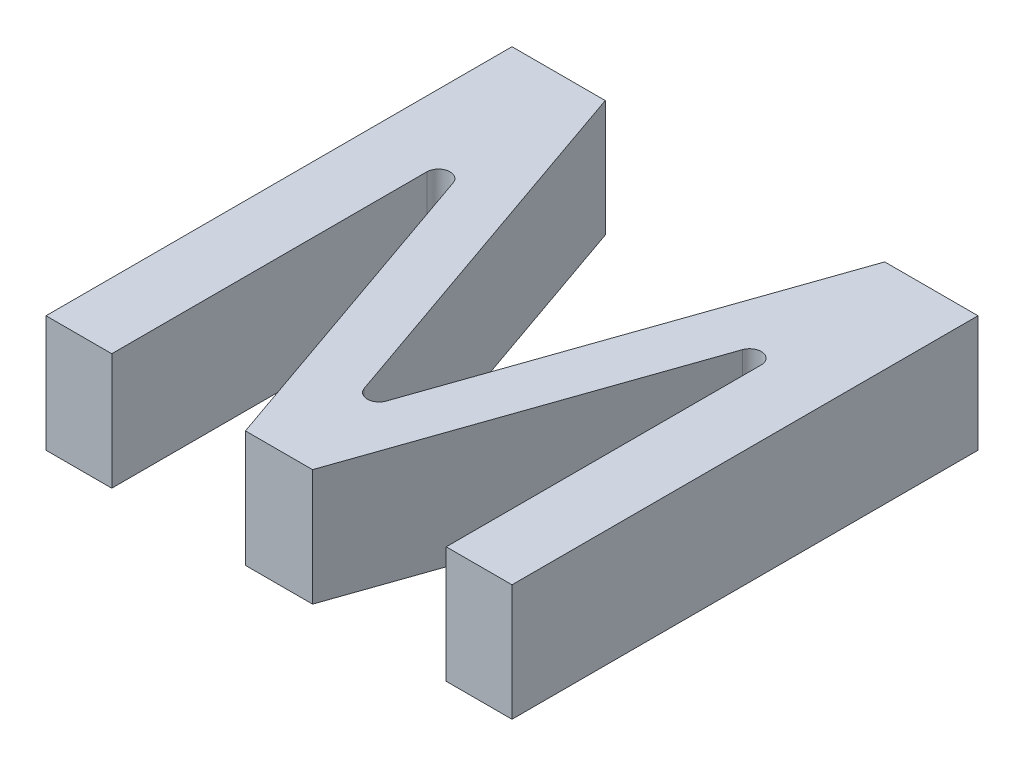
ISO-10303-21;
HEADER;
FILE_DESCRIPTION(('STEP AP214'),'2;1');
FILE_NAME('part.step','',(''),(''),'','','');
FILE_SCHEMA(('AUTOMOTIVE_DESIGN { 1 0 10303 214 1 1 1 1 }'));
ENDSEC;
DATA;
#1=APPLICATION_CONTEXT('core data for automotive mechanical design processes');
#2=APPLICATION_PROTOCOL_DEFINITION('international standard','automotive_design',2000,#1);
#3=PRODUCT_CONTEXT('',#1,'mechanical');
#4=PRODUCT('Part','Part','',(#3));
#5=PRODUCT_RELATED_PRODUCT_CATEGORY('part','',(#4));
#6=PRODUCT_DEFINITION_FORMATION('','',#4);
#7=PRODUCT_DEFINITION_CONTEXT('part definition',#1,'design');
#8=PRODUCT_DEFINITION('design','',#6,#7);
#9=PRODUCT_DEFINITION_SHAPE('','',#8);
#10=(LENGTH_UNIT() NAMED_UNIT(*) SI_UNIT(.MILLI.,.METRE.));
#11=(NAMED_UNIT(*) PLANE_ANGLE_UNIT() SI_UNIT($,.RADIAN.));
#12=(NAMED_UNIT(*) SI_UNIT($,.STERADIAN.) SOLID_ANGLE_UNIT());
#13=UNCERTAINTY_MEASURE_WITH_UNIT(LENGTH_MEASURE(1.E-05),#10,'distance_accuracy_value','');
#14=(GEOMETRIC_REPRESENTATION_CONTEXT(3) GLOBAL_UNCERTAINTY_ASSIGNED_CONTEXT((#13)) GLOBAL_UNIT_ASSIGNED_CONTEXT((#10,
#11,#12)) REPRESENTATION_CONTEXT('',''));
#15=CARTESIAN_POINT('',(0.,0.,0.));
#16=DIRECTION('',(0.,0.,1.));
#17=DIRECTION('',(1.,0.,0.));
#18=AXIS2_PLACEMENT_3D('',#15,#16,#17);
#19=CARTESIAN_POINT('',(34.3542511994083,10.,0.));
#20=DIRECTION('',(1.,0.,0.));
#21=DIRECTION('',(0.,0.,-1.));
#22=AXIS2_PLACEMENT_3D('',#19,#20,#21);
#23=PLANE('',#22);
#24=DIRECTION('',(0.,0.,1.));
#25=VECTOR('',#24,1.);
#26=CARTESIAN_POINT('',(34.3542511994083,10.,0.));
#27=LINE('',#26,#25);
#28=CARTESIAN_POINT('',(34.3542511994083,10.,-27.040857986131));
#29=VERTEX_POINT('',#28);
#30=CARTESIAN_POINT('',(34.3542511994083,10.,0.));
#31=VERTEX_POINT('',#30);
#32=EDGE_CURVE('E152',#29,#31,#27,.T.);
#33=ORIENTED_EDGE('',*,*,#32,.F.);
#34=DIRECTION('',(0.,-1.,0.));
#35=VECTOR('',#34,1.);
#36=CARTESIAN_POINT('',(34.3542511994083,10.,-27.040857986131));
#37=LINE('',#36,#35);
#38=CARTESIAN_POINT('',(34.3542511994083,0.,-27.040857986131));
#39=VERTEX_POINT('',#38);
#40=EDGE_CURVE('E178',#29,#39,#37,.T.);
#41=ORIENTED_EDGE('',*,*,#40,.T.);
#42=DIRECTION('',(0.,0.,1.));
#43=VECTOR('',#42,1.);
#44=CARTESIAN_POINT('',(34.3542511994083,0.,0.));
#45=LINE('',#44,#43);
#46=CARTESIAN_POINT('',(34.3542511994083,0.,0.));
#47=VERTEX_POINT('',#46);
#48=EDGE_CURVE('E176',#39,#47,#45,.T.);
#49=ORIENTED_EDGE('',*,*,#48,.T.);
#50=DIRECTION('',(0.,-1.,0.));
#51=VECTOR('',#50,1.);
#52=CARTESIAN_POINT('',(34.3542511994083,10.,0.));
#53=LINE('',#52,#51);
#54=EDGE_CURVE('E169',#31,#47,#53,.T.);
#55=ORIENTED_EDGE('',*,*,#54,.F.);
#56=EDGE_LOOP('',(#33,#41,#49,#55));
#57=FACE_BOUND('',#56,.T.);
#58=ADVANCED_FACE('F40',(#57),#23,.F.);
#59=CARTESIAN_POINT('',(0.,10.,0.));
#60=DIRECTION('',(0.,0.,-1.));
#61=DIRECTION('',(-1.,0.,0.));
#62=AXIS2_PLACEMENT_3D('',#59,#60,#61);
#63=PLANE('',#62);
#64=DIRECTION('',(1.,0.,0.));
#65=VECTOR('',#64,1.);
#66=CARTESIAN_POINT('',(0.,0.,0.));
#67=LINE('',#66,#65);
#68=CARTESIAN_POINT('',(40.,0.,0.));
#69=VERTEX_POINT('',#68);
#70=EDGE_CURVE('E272',#47,#69,#67,.T.);
#71=ORIENTED_EDGE('',*,*,#70,.T.);
#72=DIRECTION('',(0.,-1.,0.));
#73=VECTOR('',#72,1.);
#74=CARTESIAN_POINT('',(40.,10.,0.));
#75=LINE('',#74,#73);
#76=CARTESIAN_POINT('',(40.,10.,0.));
#77=VERTEX_POINT('',#76);
#78=EDGE_CURVE('E171',#77,#69,#75,.T.);
#79=ORIENTED_EDGE('',*,*,#78,.F.);
#80=DIRECTION('',(1.,0.,0.));
#81=VECTOR('',#80,1.);
#82=CARTESIAN_POINT('',(0.,10.,0.));
#83=LINE('',#82,#81);
#84=EDGE_CURVE('E156',#31,#77,#83,.T.);
#85=ORIENTED_EDGE('',*,*,#84,.F.);
#86=ORIENTED_EDGE('',*,*,#54,.T.);
#87=EDGE_LOOP('',(#71,#79,#85,#86));
#88=FACE_BOUND('',#87,.T.);
#89=ADVANCED_FACE('F168',(#88),#63,.F.);
#90=CARTESIAN_POINT('',(40.,10.,0.));
#91=DIRECTION('',(-1.,0.,0.));
#92=DIRECTION('',(0.,0.,1.));
#93=AXIS2_PLACEMENT_3D('',#90,#91,#92);
#94=PLANE('',#93);
#95=DIRECTION('',(0.,0.,-1.));
#96=VECTOR('',#95,1.);
#97=CARTESIAN_POINT('',(40.,0.,0.));
#98=LINE('',#97,#96);
#99=CARTESIAN_POINT('',(40.,0.,-40.));
#100=VERTEX_POINT('',#99);
#101=EDGE_CURVE('E270',#69,#100,#98,.T.);
#102=ORIENTED_EDGE('',*,*,#101,.T.);
#103=DIRECTION('',(0.,-1.,0.));
#104=VECTOR('',#103,1.);
#105=CARTESIAN_POINT('',(40.,10.,-40.));
#106=LINE('',#105,#104);
#107=CARTESIAN_POINT('',(40.,10.,-40.));
#108=VERTEX_POINT('',#107);
#109=EDGE_CURVE('E182',#108,#100,#106,.T.);
#110=ORIENTED_EDGE('',*,*,#109,.F.);
#111=DIRECTION('',(0.,0.,-1.));
#112=VECTOR('',#111,1.);
#113=CARTESIAN_POINT('',(40.,10.,0.));
#114=LINE('',#113,#112);
#115=EDGE_CURVE('E173',#77,#108,#114,.T.);
#116=ORIENTED_EDGE('',*,*,#115,.F.);
#117=ORIENTED_EDGE('',*,*,#78,.T.);
#118=EDGE_LOOP('',(#102,#110,#116,#117));
#119=FACE_BOUND('',#118,.T.);
#120=ADVANCED_FACE('F271',(#119),#94,.F.);
#121=CARTESIAN_POINT('',(0.,10.,-40.));
#122=DIRECTION('',(0.,0.,-1.));
#123=DIRECTION('',(-1.,0.,0.));
#124=AXIS2_PLACEMENT_3D('',#121,#122,#123);
#125=PLANE('',#124);
#126=DIRECTION('',(1.,0.,0.));
#127=VECTOR('',#126,1.);
#128=CARTESIAN_POINT('',(0.,0.,-40.));
#129=LINE('',#128,#127);
#130=CARTESIAN_POINT('',(31.9953760727811,0.,-40.));
#131=VERTEX_POINT('',#130);
#132=EDGE_CURVE('E265',#131,#100,#129,.T.);
#133=ORIENTED_EDGE('',*,*,#132,.F.);
#134=DIRECTION('',(0.,-1.,0.));
#135=VECTOR('',#134,1.);
#136=CARTESIAN_POINT('',(31.9953760727811,10.,-40.));
#137=LINE('',#136,#135);
#138=CARTESIAN_POINT('',(31.9953760727811,10.,-40.));
#139=VERTEX_POINT('',#138);
#140=EDGE_CURVE('E257',#139,#131,#137,.T.);
#141=ORIENTED_EDGE('',*,*,#140,.F.);
#142=DIRECTION('',(1.,0.,0.));
#143=VECTOR('',#142,1.);
#144=CARTESIAN_POINT('',(0.,10.,-40.));
#145=LINE('',#144,#143);
#146=EDGE_CURVE('E267',#139,#108,#145,.T.);
#147=ORIENTED_EDGE('',*,*,#146,.T.);
#148=ORIENTED_EDGE('',*,*,#109,.T.);
#149=EDGE_LOOP('',(#133,#141,#147,#148));
#150=FACE_BOUND('',#149,.T.);
#151=ADVANCED_FACE('F263',(#150),#125,.T.);
#152=CARTESIAN_POINT('',(16.1154493969391,10.,5.61078200234492));
#153=DIRECTION('',(0.944398412927786,0.,0.328803341922613));
#154=DIRECTION('',(0.328803341922613,0.,-0.944398412927786));
#155=AXIS2_PLACEMENT_3D('',#152,#153,#154);
#156=PLANE('',#155);
#157=DIRECTION('',(-0.328803341922613,0.,0.944398412927786));
#158=VECTOR('',#157,1.);
#159=CARTESIAN_POINT('',(16.1154493969391,0.,5.61078200234492));
#160=LINE('',#159,#158);
#161=CARTESIAN_POINT('',(20.9443984129278,0.,-8.25906421072143));
#162=VERTEX_POINT('',#161);
#163=EDGE_CURVE('E274',#131,#162,#160,.T.);
#164=ORIENTED_EDGE('',*,*,#163,.T.);
#165=DIRECTION('',(0.,-1.,0.));
#166=VECTOR('',#165,1.);
#167=CARTESIAN_POINT('',(20.9443984129278,10.,-8.25906421072143));
#168=LINE('',#167,#166);
#169=CARTESIAN_POINT('',(20.9443984129278,10.,-8.25906421072143));
#170=VERTEX_POINT('',#169);
#171=EDGE_CURVE('E55',#162,#170,#168,.F.);
#172=ORIENTED_EDGE('',*,*,#171,.T.);
#173=DIRECTION('',(-0.328803341922613,0.,0.944398412927786));
#174=VECTOR('',#173,1.);
#175=CARTESIAN_POINT('',(16.1154493969391,10.,5.61078200234492));
#176=LINE('',#175,#174);
#177=EDGE_CURVE('E306',#139,#170,#176,.T.);
#178=ORIENTED_EDGE('',*,*,#177,.F.);
#179=ORIENTED_EDGE('',*,*,#140,.T.);
#180=EDGE_LOOP('',(#164,#172,#178,#179));
#181=FACE_BOUND('',#180,.T.);
#182=ADVANCED_FACE('F344',(#181),#156,.F.);
#183=CARTESIAN_POINT('',(19.5600850966818,10.,-6.81007216873779));
#184=DIRECTION('',(0.944398412927786,0.,-0.328803341922613));
#185=DIRECTION('',(-0.328803341922613,0.,-0.944398412927786));
#186=AXIS2_PLACEMENT_3D('',#183,#184,#185);
#187=PLANE('',#186);
#188=DIRECTION('',(0.328803341922613,0.,0.944398412927786));
#189=VECTOR('',#188,1.);
#190=CARTESIAN_POINT('',(19.5600850966818,10.,-6.81007216873779));
#191=LINE('',#190,#189);
#192=CARTESIAN_POINT('',(8.00462392721893,10.,-40.));
#193=VERTEX_POINT('',#192);
#194=CARTESIAN_POINT('',(19.0556015870722,10.,-8.25906421072143));
#195=VERTEX_POINT('',#194);
#196=EDGE_CURVE('E303',#193,#195,#191,.T.);
#197=ORIENTED_EDGE('',*,*,#196,.T.);
#198=DIRECTION('',(0.,-1.,0.));
#199=VECTOR('',#198,1.);
#200=CARTESIAN_POINT('',(19.0556015870722,10.,-8.25906421072143));
#201=LINE('',#200,#199);
#202=CARTESIAN_POINT('',(19.0556015870722,0.,-8.25906421072143));
#203=VERTEX_POINT('',#202);
#204=EDGE_CURVE('E192',#195,#203,#201,.T.);
#205=ORIENTED_EDGE('',*,*,#204,.T.);
#206=DIRECTION('',(0.328803341922613,0.,0.944398412927786));
#207=VECTOR('',#206,1.);
#208=CARTESIAN_POINT('',(19.5600850966818,0.,-6.81007216873779));
#209=LINE('',#208,#207);
#210=CARTESIAN_POINT('',(8.00462392721893,0.,-40.));
#211=VERTEX_POINT('',#210);
#212=EDGE_CURVE('E276',#211,#203,#209,.T.);
#213=ORIENTED_EDGE('',*,*,#212,.F.);
#214=DIRECTION('',(0.,-1.,0.));
#215=VECTOR('',#214,1.);
#216=CARTESIAN_POINT('',(8.00462392721893,10.,-40.));
#217=LINE('',#216,#215);
#218=EDGE_CURVE('E255',#193,#211,#217,.T.);
#219=ORIENTED_EDGE('',*,*,#218,.F.);
#220=EDGE_LOOP('',(#197,#205,#213,#219));
#221=FACE_BOUND('',#220,.T.);
#222=ADVANCED_FACE('F301',(#221),#187,.T.);
#223=CARTESIAN_POINT('',(0.,10.,-40.));
#224=DIRECTION('',(0.,0.,-1.));
#225=DIRECTION('',(-1.,0.,0.));
#226=AXIS2_PLACEMENT_3D('',#223,#224,#225);
#227=PLANE('',#226);
#228=DIRECTION('',(1.,0.,0.));
#229=VECTOR('',#228,1.);
#230=CARTESIAN_POINT('',(0.,0.,-40.));
#231=LINE('',#230,#229);
#232=CARTESIAN_POINT('',(0.,0.,-40.));
#233=VERTEX_POINT('',#232);
#234=EDGE_CURVE('E281',#233,#211,#231,.T.);
#235=ORIENTED_EDGE('',*,*,#234,.F.);
#236=DIRECTION('',(0.,-1.,0.));
#237=VECTOR('',#236,1.);
#238=CARTESIAN_POINT('',(0.,10.,-40.));
#239=LINE('',#238,#237);
#240=CARTESIAN_POINT('',(0.,10.,-40.));
#241=VERTEX_POINT('',#240);
#242=EDGE_CURVE('E253',#241,#233,#239,.T.);
#243=ORIENTED_EDGE('',*,*,#242,.F.);
#244=DIRECTION('',(1.,0.,0.));
#245=VECTOR('',#244,1.);
#246=CARTESIAN_POINT('',(0.,10.,-40.));
#247=LINE('',#246,#245);
#248=EDGE_CURVE('E297',#241,#193,#247,.T.);
#249=ORIENTED_EDGE('',*,*,#248,.T.);
#250=ORIENTED_EDGE('',*,*,#218,.T.);
#251=EDGE_LOOP('',(#235,#243,#249,#250));
#252=FACE_BOUND('',#251,.T.);
#253=ADVANCED_FACE('F295',(#252),#227,.T.);
#254=CARTESIAN_POINT('',(0.,10.,0.));
#255=DIRECTION('',(-1.,0.,0.));
#256=DIRECTION('',(0.,0.,1.));
#257=AXIS2_PLACEMENT_3D('',#254,#255,#256);
#258=PLANE('',#257);
#259=DIRECTION('',(0.,0.,-1.));
#260=VECTOR('',#259,1.);
#261=CARTESIAN_POINT('',(0.,0.,0.));
#262=LINE('',#261,#260);
#263=CARTESIAN_POINT('',(0.,0.,0.));
#264=VERTEX_POINT('',#263);
#265=EDGE_CURVE('E238',#264,#233,#262,.T.);
#266=ORIENTED_EDGE('',*,*,#265,.F.);
#267=DIRECTION('',(0.,-1.,0.));
#268=VECTOR('',#267,1.);
#269=CARTESIAN_POINT('',(0.,10.,0.));
#270=LINE('',#269,#268);
#271=CARTESIAN_POINT('',(0.,10.,0.));
#272=VERTEX_POINT('',#271);
#273=EDGE_CURVE('E251',#272,#264,#270,.T.);
#274=ORIENTED_EDGE('',*,*,#273,.F.);
#275=DIRECTION('',(0.,0.,-1.));
#276=VECTOR('',#275,1.);
#277=CARTESIAN_POINT('',(0.,10.,0.));
#278=LINE('',#277,#276);
#279=EDGE_CURVE('E291',#272,#241,#278,.T.);
#280=ORIENTED_EDGE('',*,*,#279,.T.);
#281=ORIENTED_EDGE('',*,*,#242,.T.);
#282=EDGE_LOOP('',(#266,#274,#280,#281));
#283=FACE_BOUND('',#282,.T.);
#284=ADVANCED_FACE('F287',(#283),#258,.T.);
#285=CARTESIAN_POINT('',(0.,10.,0.));
#286=DIRECTION('',(0.,0.,-1.));
#287=DIRECTION('',(-1.,0.,0.));
#288=AXIS2_PLACEMENT_3D('',#285,#286,#287);
#289=PLANE('',#288);
#290=DIRECTION('',(1.,0.,0.));
#291=VECTOR('',#290,1.);
#292=CARTESIAN_POINT('',(0.,0.,0.));
#293=LINE('',#292,#291);
#294=CARTESIAN_POINT('',(5.64574880059171,0.,0.));
#295=VERTEX_POINT('',#294);
#296=EDGE_CURVE('E234',#264,#295,#293,.T.);
#297=ORIENTED_EDGE('',*,*,#296,.T.);
#298=DIRECTION('',(0.,-1.,0.));
#299=VECTOR('',#298,1.);
#300=CARTESIAN_POINT('',(5.64574880059171,10.,0.));
#301=LINE('',#300,#299);
#302=CARTESIAN_POINT('',(5.64574880059171,10.,0.));
#303=VERTEX_POINT('',#302);
#304=EDGE_CURVE('E232',#303,#295,#301,.T.);
#305=ORIENTED_EDGE('',*,*,#304,.F.);
#306=DIRECTION('',(1.,0.,0.));
#307=VECTOR('',#306,1.);
#308=CARTESIAN_POINT('',(0.,10.,0.));
#309=LINE('',#308,#307);
#310=EDGE_CURVE('E314',#272,#303,#309,.T.);
#311=ORIENTED_EDGE('',*,*,#310,.F.);
#312=ORIENTED_EDGE('',*,*,#273,.T.);
#313=EDGE_LOOP('',(#297,#305,#311,#312));
#314=FACE_BOUND('',#313,.T.);
#315=ADVANCED_FACE('F353',(#314),#289,.F.);
#316=CARTESIAN_POINT('',(5.64574880059171,10.,0.));
#317=DIRECTION('',(1.,0.,0.));
#318=DIRECTION('',(0.,0.,-1.));
#319=AXIS2_PLACEMENT_3D('',#316,#317,#318);
#320=PLANE('',#319);
#321=DIRECTION('',(0.,0.,1.));
#322=VECTOR('',#321,1.);
#323=CARTESIAN_POINT('',(5.64574880059171,0.,0.));
#324=LINE('',#323,#322);
#325=CARTESIAN_POINT('',(5.64574880059171,0.,-27.040857986131));
#326=VERTEX_POINT('',#325);
#327=EDGE_CURVE('E225',#326,#295,#324,.T.);
#328=ORIENTED_EDGE('',*,*,#327,.F.);
#329=DIRECTION('',(0.,-1.,0.));
#330=VECTOR('',#329,1.);
#331=CARTESIAN_POINT('',(5.64574880059171,10.,-27.040857986131));
#332=LINE('',#331,#330);
#333=CARTESIAN_POINT('',(5.64574880059171,10.,-27.040857986131));
#334=VERTEX_POINT('',#333);
#335=EDGE_CURVE('E190',#326,#334,#332,.F.);
#336=ORIENTED_EDGE('',*,*,#335,.T.);
#337=DIRECTION('',(0.,0.,1.));
#338=VECTOR('',#337,1.);
#339=CARTESIAN_POINT('',(5.64574880059171,10.,0.));
#340=LINE('',#339,#338);
#341=EDGE_CURVE('E209',#334,#303,#340,.T.);
#342=ORIENTED_EDGE('',*,*,#341,.T.);
#343=ORIENTED_EDGE('',*,*,#304,.T.);
#344=EDGE_LOOP('',(#328,#336,#342,#343));
#345=FACE_BOUND('',#344,.T.);
#346=ADVANCED_FACE('F230',(#345),#320,.T.);
#347=CARTESIAN_POINT('',(15.2684282698813,10.,-5.31588170026556));
#348=DIRECTION('',(0.944398412927786,0.,-0.328803341922613));
#349=DIRECTION('',(-0.328803341922613,0.,-0.944398412927786));
#350=AXIS2_PLACEMENT_3D('',#347,#348,#349);
#351=PLANE('',#350);
#352=DIRECTION('',(0.328803341922613,0.,0.944398412927786));
#353=VECTOR('',#352,1.);
#354=CARTESIAN_POINT('',(15.2684282698813,10.,-5.31588170026556));
#355=LINE('',#354,#353);
#356=CARTESIAN_POINT('',(7.5901472135195,10.,-27.3696613280536));
#357=VERTEX_POINT('',#356);
#358=CARTESIAN_POINT('',(17.1192145952139,10.,0.));
#359=VERTEX_POINT('',#358);
#360=EDGE_CURVE('E206',#357,#359,#355,.T.);
#361=ORIENTED_EDGE('',*,*,#360,.F.);
#362=DIRECTION('',(0.,-1.,0.));
#363=VECTOR('',#362,1.);
#364=CARTESIAN_POINT('',(7.5901472135195,10.,-27.3696613280536));
#365=LINE('',#364,#363);
#366=CARTESIAN_POINT('',(7.5901472135195,0.,-27.3696613280536));
#367=VERTEX_POINT('',#366);
#368=EDGE_CURVE('E187',#357,#367,#365,.T.);
#369=ORIENTED_EDGE('',*,*,#368,.T.);
#370=DIRECTION('',(0.328803341922613,0.,0.944398412927786));
#371=VECTOR('',#370,1.);
#372=CARTESIAN_POINT('',(15.2684282698813,0.,-5.31588170026556));
#373=LINE('',#372,#371);
#374=CARTESIAN_POINT('',(17.1192145952139,0.,0.));
#375=VERTEX_POINT('',#374);
#376=EDGE_CURVE('E228',#367,#375,#373,.T.);
#377=ORIENTED_EDGE('',*,*,#376,.T.);
#378=DIRECTION('',(0.,-1.,0.));
#379=VECTOR('',#378,1.);
#380=CARTESIAN_POINT('',(17.1192145952139,10.,0.));
#381=LINE('',#380,#379);
#382=EDGE_CURVE('E217',#359,#375,#381,.T.);
#383=ORIENTED_EDGE('',*,*,#382,.F.);
#384=EDGE_LOOP('',(#361,#369,#377,#383));
#385=FACE_BOUND('',#384,.T.);
#386=ADVANCED_FACE('F214',(#385),#351,.F.);
#387=CARTESIAN_POINT('',(0.,10.,0.));
#388=DIRECTION('',(0.,0.,-1.));
#389=DIRECTION('',(-1.,0.,0.));
#390=AXIS2_PLACEMENT_3D('',#387,#388,#389);
#391=PLANE('',#390);
#392=DIRECTION('',(1.,0.,0.));
#393=VECTOR('',#392,1.);
#394=CARTESIAN_POINT('',(0.,0.,0.));
#395=LINE('',#394,#393);
#396=CARTESIAN_POINT('',(22.8807854047861,0.,0.));
#397=VERTEX_POINT('',#396);
#398=EDGE_CURVE('E236',#375,#397,#395,.T.);
#399=ORIENTED_EDGE('',*,*,#398,.T.);
#400=DIRECTION('',(0.,-1.,0.));
#401=VECTOR('',#400,1.);
#402=CARTESIAN_POINT('',(22.8807854047861,10.,0.));
#403=LINE('',#402,#401);
#404=CARTESIAN_POINT('',(22.8807854047861,10.,0.));
#405=VERTEX_POINT('',#404);
#406=EDGE_CURVE('E245',#405,#397,#403,.T.);
#407=ORIENTED_EDGE('',*,*,#406,.F.);
#408=DIRECTION('',(1.,0.,0.));
#409=VECTOR('',#408,1.);
#410=CARTESIAN_POINT('',(0.,10.,0.));
#411=LINE('',#410,#409);
#412=EDGE_CURVE('E219',#359,#405,#411,.T.);
#413=ORIENTED_EDGE('',*,*,#412,.F.);
#414=ORIENTED_EDGE('',*,*,#382,.T.);
#415=EDGE_LOOP('',(#399,#407,#413,#414));
#416=FACE_BOUND('',#415,.T.);
#417=ADVANCED_FACE('F361',(#416),#391,.F.);
#418=CARTESIAN_POINT('',(20.4071062237396,10.,7.10497247081715));
#419=DIRECTION('',(0.944398412927786,0.,0.328803341922613));
#420=DIRECTION('',(0.328803341922613,0.,-0.944398412927786));
#421=AXIS2_PLACEMENT_3D('',#418,#419,#420);
#422=PLANE('',#421);
#423=DIRECTION('',(-0.328803341922613,0.,0.944398412927786));
#424=VECTOR('',#423,1.);
#425=CARTESIAN_POINT('',(20.4071062237396,0.,7.10497247081715));
#426=LINE('',#425,#424);
#427=CARTESIAN_POINT('',(32.4098527864805,0.,-27.3696613280536));
#428=VERTEX_POINT('',#427);
#429=EDGE_CURVE('E164',#428,#397,#426,.T.);
#430=ORIENTED_EDGE('',*,*,#429,.F.);
#431=DIRECTION('',(0.,-1.,0.));
#432=VECTOR('',#431,1.);
#433=CARTESIAN_POINT('',(32.4098527864805,10.,-27.3696613280536));
#434=LINE('',#433,#432);
#435=CARTESIAN_POINT('',(32.4098527864805,10.,-27.3696613280536));
#436=VERTEX_POINT('',#435);
#437=EDGE_CURVE('E180',#428,#436,#434,.F.);
#438=ORIENTED_EDGE('',*,*,#437,.T.);
#439=DIRECTION('',(-0.328803341922613,0.,0.944398412927786));
#440=VECTOR('',#439,1.);
#441=CARTESIAN_POINT('',(20.4071062237396,10.,7.10497247081715));
#442=LINE('',#441,#440);
#443=EDGE_CURVE('E248',#436,#405,#442,.T.);
#444=ORIENTED_EDGE('',*,*,#443,.T.);
#445=ORIENTED_EDGE('',*,*,#406,.T.);
#446=EDGE_LOOP('',(#430,#438,#444,#445));
#447=FACE_BOUND('',#446,.T.);
#448=ADVANCED_FACE('F323',(#447),#422,.T.);
#449=CARTESIAN_POINT('',(0.,10.,0.));
#450=DIRECTION('',(0.,1.,0.));
#451=DIRECTION('',(0.,0.,1.));
#452=AXIS2_PLACEMENT_3D('',#449,#450,#451);
#453=PLANE('',#452);
#454=ORIENTED_EDGE('',*,*,#443,.F.);
#455=CARTESIAN_POINT('',(33.3542511994083,10.,-27.040857986131));
#456=DIRECTION('',(0.,1.,0.));
#457=DIRECTION('',(0.,0.,1.));
#458=AXIS2_PLACEMENT_3D('',#455,#456,#457);
#459=CIRCLE('',#458,1.);
#460=EDGE_CURVE('E159',#436,#29,#459,.F.);
#461=ORIENTED_EDGE('',*,*,#460,.T.);
#462=ORIENTED_EDGE('',*,*,#32,.T.);
#463=ORIENTED_EDGE('',*,*,#84,.T.);
#464=ORIENTED_EDGE('',*,*,#115,.T.);
#465=ORIENTED_EDGE('',*,*,#146,.F.);
#466=ORIENTED_EDGE('',*,*,#177,.T.);
#467=CARTESIAN_POINT('',(20.,10.,-8.58786755264404));
#468=DIRECTION('',(0.,1.,0.));
#469=DIRECTION('',(0.,0.,1.));
#470=AXIS2_PLACEMENT_3D('',#467,#468,#469);
#471=CIRCLE('',#470,1.);
#472=EDGE_CURVE('E11',#170,#195,#471,.F.);
#473=ORIENTED_EDGE('',*,*,#472,.T.);
#474=ORIENTED_EDGE('',*,*,#196,.F.);
#475=ORIENTED_EDGE('',*,*,#248,.F.);
#476=ORIENTED_EDGE('',*,*,#279,.F.);
#477=ORIENTED_EDGE('',*,*,#310,.T.);
#478=ORIENTED_EDGE('',*,*,#341,.F.);
#479=CARTESIAN_POINT('',(6.64574880059171,10.,-27.040857986131));
#480=DIRECTION('',(0.,1.,0.));
#481=DIRECTION('',(0.,0.,1.));
#482=AXIS2_PLACEMENT_3D('',#479,#480,#481);
#483=CIRCLE('',#482,1.);
#484=EDGE_CURVE('E201',#334,#357,#483,.F.);
#485=ORIENTED_EDGE('',*,*,#484,.T.);
#486=ORIENTED_EDGE('',*,*,#360,.T.);
#487=ORIENTED_EDGE('',*,*,#412,.T.);
#488=EDGE_LOOP('',(#454,#461,#462,#463,#464,#465,#466,#473,#474,#475,#476,#477,#478,#485,#486,#487));
#489=FACE_BOUND('',#488,.T.);
#490=ADVANCED_FACE('F155',(#489),#453,.T.);
#491=CARTESIAN_POINT('',(0.,0.,0.));
#492=DIRECTION('',(0.,1.,0.));
#493=DIRECTION('',(0.,0.,1.));
#494=AXIS2_PLACEMENT_3D('',#491,#492,#493);
#495=PLANE('',#494);
#496=ORIENTED_EDGE('',*,*,#48,.F.);
#497=CARTESIAN_POINT('',(33.3542511994083,0.,-27.040857986131));
#498=DIRECTION('',(0.,1.,0.));
#499=DIRECTION('',(0.,0.,1.));
#500=AXIS2_PLACEMENT_3D('',#497,#498,#499);
#501=CIRCLE('',#500,1.);
#502=EDGE_CURVE('E196',#39,#428,#501,.T.);
#503=ORIENTED_EDGE('',*,*,#502,.T.);
#504=ORIENTED_EDGE('',*,*,#429,.T.);
#505=ORIENTED_EDGE('',*,*,#398,.F.);
#506=ORIENTED_EDGE('',*,*,#376,.F.);
#507=CARTESIAN_POINT('',(6.64574880059171,0.,-27.040857986131));
#508=DIRECTION('',(0.,1.,0.));
#509=DIRECTION('',(0.,0.,1.));
#510=AXIS2_PLACEMENT_3D('',#507,#508,#509);
#511=CIRCLE('',#510,1.);
#512=EDGE_CURVE('E199',#367,#326,#511,.T.);
#513=ORIENTED_EDGE('',*,*,#512,.T.);
#514=ORIENTED_EDGE('',*,*,#327,.T.);
#515=ORIENTED_EDGE('',*,*,#296,.F.);
#516=ORIENTED_EDGE('',*,*,#265,.T.);
#517=ORIENTED_EDGE('',*,*,#234,.T.);
#518=ORIENTED_EDGE('',*,*,#212,.T.);
#519=CARTESIAN_POINT('',(20.,0.,-8.58786755264404));
#520=DIRECTION('',(0.,1.,0.));
#521=DIRECTION('',(0.,0.,1.));
#522=AXIS2_PLACEMENT_3D('',#519,#520,#521);
#523=CIRCLE('',#522,1.);
#524=EDGE_CURVE('E48',#203,#162,#523,.T.);
#525=ORIENTED_EDGE('',*,*,#524,.T.);
#526=ORIENTED_EDGE('',*,*,#163,.F.);
#527=ORIENTED_EDGE('',*,*,#132,.T.);
#528=ORIENTED_EDGE('',*,*,#101,.F.);
#529=ORIENTED_EDGE('',*,*,#70,.F.);
#530=EDGE_LOOP('',(#496,#503,#504,#505,#506,#513,#514,#515,#516,#517,#518,#525,#526,#527,#528,#529));
#531=FACE_BOUND('',#530,.T.);
#532=ADVANCED_FACE('F223',(#531),#495,.F.);
#533=CARTESIAN_POINT('',(33.3542511994083,10.,-27.040857986131));
#534=DIRECTION('',(0.,-1.,0.));
#535=DIRECTION('',(0.,0.,-1.));
#536=AXIS2_PLACEMENT_3D('',#533,#534,#535);
#537=CYLINDRICAL_SURFACE('',#536,1.);
#538=ORIENTED_EDGE('',*,*,#460,.F.);
#539=ORIENTED_EDGE('',*,*,#437,.F.);
#540=ORIENTED_EDGE('',*,*,#502,.F.);
#541=ORIENTED_EDGE('',*,*,#40,.F.);
#542=EDGE_LOOP('',(#538,#539,#540,#541));
#543=FACE_BOUND('',#542,.T.);
#544=ADVANCED_FACE('F325',(#543),#537,.F.);
#545=CARTESIAN_POINT('',(6.64574880059171,10.,-27.040857986131));
#546=DIRECTION('',(0.,-1.,0.));
#547=DIRECTION('',(0.,0.,-1.));
#548=AXIS2_PLACEMENT_3D('',#545,#546,#547);
#549=CYLINDRICAL_SURFACE('',#548,1.);
#550=ORIENTED_EDGE('',*,*,#484,.F.);
#551=ORIENTED_EDGE('',*,*,#335,.F.);
#552=ORIENTED_EDGE('',*,*,#512,.F.);
#553=ORIENTED_EDGE('',*,*,#368,.F.);
#554=EDGE_LOOP('',(#550,#551,#552,#553));
#555=FACE_BOUND('',#554,.T.);
#556=ADVANCED_FACE('F221',(#555),#549,.F.);
#557=CARTESIAN_POINT('',(20.,10.,-8.58786755264404));
#558=DIRECTION('',(0.,-1.,0.));
#559=DIRECTION('',(0.,0.,-1.));
#560=AXIS2_PLACEMENT_3D('',#557,#558,#559);
#561=CYLINDRICAL_SURFACE('',#560,1.);
#562=ORIENTED_EDGE('',*,*,#472,.F.);
#563=ORIENTED_EDGE('',*,*,#171,.F.);
#564=ORIENTED_EDGE('',*,*,#524,.F.);
#565=ORIENTED_EDGE('',*,*,#204,.F.);
#566=EDGE_LOOP('',(#562,#563,#564,#565));
#567=FACE_BOUND('',#566,.T.);
#568=ADVANCED_FACE('F42',(#567),#561,.F.);
#569=CLOSED_SHELL('',(#58,#89,#120,#151,#182,#222,#253,#284,#315,#346,#386,#417,#448,#490,#532,
#544,#556,#568));
#570=MANIFOLD_SOLID_BREP('B2',#569);
#571=ADVANCED_BREP_SHAPE_REPRESENTATION('',(#18,#570),#14);
#572=SHAPE_DEFINITION_REPRESENTATION(#9,#571);
ENDSEC;
END-ISO-10303-21;
